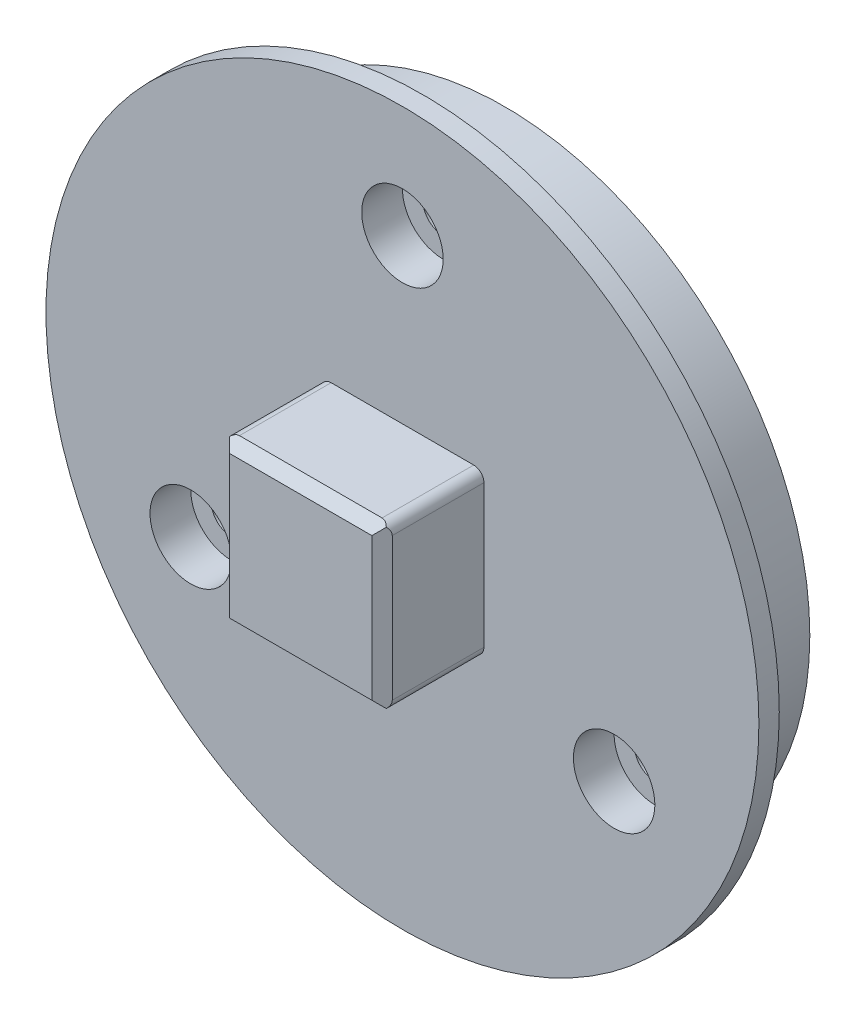
ISO-10303-21;
HEADER;
FILE_DESCRIPTION(('STEP AP214'),'2;1');
FILE_NAME('part.step','',(''),(''),'','','');
FILE_SCHEMA(('AUTOMOTIVE_DESIGN { 1 0 10303 214 1 1 1 1 }'));
ENDSEC;
DATA;
#1=APPLICATION_CONTEXT('core data for automotive mechanical design processes');
#2=APPLICATION_PROTOCOL_DEFINITION('international standard','automotive_design',2000,#1);
#3=PRODUCT_CONTEXT('',#1,'mechanical');
#4=PRODUCT('Part','Part','',(#3));
#5=PRODUCT_RELATED_PRODUCT_CATEGORY('part','',(#4));
#6=PRODUCT_DEFINITION_FORMATION('','',#4);
#7=PRODUCT_DEFINITION_CONTEXT('part definition',#1,'design');
#8=PRODUCT_DEFINITION('design','',#6,#7);
#9=PRODUCT_DEFINITION_SHAPE('','',#8);
#10=(LENGTH_UNIT() NAMED_UNIT(*) SI_UNIT(.MILLI.,.METRE.));
#11=(NAMED_UNIT(*) PLANE_ANGLE_UNIT() SI_UNIT($,.RADIAN.));
#12=(NAMED_UNIT(*) SI_UNIT($,.STERADIAN.) SOLID_ANGLE_UNIT());
#13=UNCERTAINTY_MEASURE_WITH_UNIT(LENGTH_MEASURE(1.E-05),#10,'distance_accuracy_value','');
#14=(GEOMETRIC_REPRESENTATION_CONTEXT(3) GLOBAL_UNCERTAINTY_ASSIGNED_CONTEXT((#13)) GLOBAL_UNIT_ASSIGNED_CONTEXT((#10,
#11,#12)) REPRESENTATION_CONTEXT('',''));
#15=CARTESIAN_POINT('',(0.,0.,0.));
#16=DIRECTION('',(0.,0.,1.));
#17=DIRECTION('',(1.,0.,0.));
#18=AXIS2_PLACEMENT_3D('',#15,#16,#17);
#19=CARTESIAN_POINT('',(0.,0.,5.));
#20=DIRECTION('',(0.,0.,1.));
#21=DIRECTION('',(1.,0.,0.));
#22=AXIS2_PLACEMENT_3D('',#19,#20,#21);
#23=PLANE('',#22);
#24=CARTESIAN_POINT('',(0.,12.,5.));
#25=DIRECTION('',(0.,0.,1.));
#26=DIRECTION('',(1.,0.,0.));
#27=AXIS2_PLACEMENT_3D('',#24,#25,#26);
#28=CIRCLE('',#27,2.);
#29=CARTESIAN_POINT('',(2.,12.,5.));
#30=VERTEX_POINT('',#29);
#31=EDGE_CURVE('E305',#30,#30,#28,.T.);
#32=ORIENTED_EDGE('',*,*,#31,.F.);
#33=EDGE_LOOP('',(#32));
#34=FACE_BOUND('',#33,.T.);
#35=CARTESIAN_POINT('',(10.392304845414,-5.99999999999956,5.));
#36=DIRECTION('',(0.,0.,1.));
#37=DIRECTION('',(1.,0.,0.));
#38=AXIS2_PLACEMENT_3D('',#35,#36,#37);
#39=CIRCLE('',#38,2.00000000000066);
#40=CARTESIAN_POINT('',(12.3923048454147,-5.99999999999956,5.));
#41=VERTEX_POINT('',#40);
#42=EDGE_CURVE('E299',#41,#41,#39,.T.);
#43=ORIENTED_EDGE('',*,*,#42,.F.);
#44=EDGE_LOOP('',(#43));
#45=FACE_BOUND('',#44,.T.);
#46=CARTESIAN_POINT('',(-10.3923048454125,-6.00000000000045,5.));
#47=DIRECTION('',(0.,0.,1.));
#48=DIRECTION('',(1.,0.,0.));
#49=AXIS2_PLACEMENT_3D('',#46,#47,#48);
#50=CIRCLE('',#49,2.00000000000097);
#51=CARTESIAN_POINT('',(-8.39230484541153,-6.00000000000045,5.));
#52=VERTEX_POINT('',#51);
#53=EDGE_CURVE('E292',#52,#52,#50,.T.);
#54=ORIENTED_EDGE('',*,*,#53,.F.);
#55=EDGE_LOOP('',(#54));
#56=FACE_BOUND('',#55,.T.);
#57=CARTESIAN_POINT('',(0.,0.,5.));
#58=DIRECTION('',(0.,0.,1.));
#59=DIRECTION('',(1.,0.,0.));
#60=AXIS2_PLACEMENT_3D('',#57,#58,#59);
#61=CIRCLE('',#60,17.5);
#62=CARTESIAN_POINT('',(17.5,0.,5.));
#63=VERTEX_POINT('',#62);
#64=EDGE_CURVE('E266',#63,#63,#61,.T.);
#65=ORIENTED_EDGE('',*,*,#64,.T.);
#66=EDGE_LOOP('',(#65));
#67=FACE_BOUND('',#66,.T.);
#68=DIRECTION('',(1.,0.,0.));
#69=VECTOR('',#68,1.);
#70=CARTESIAN_POINT('',(4.,-4.,5.));
#71=LINE('',#70,#69);
#72=CARTESIAN_POINT('',(-3.5,-4.,5.));
#73=VERTEX_POINT('',#72);
#74=CARTESIAN_POINT('',(3.5,-4.,5.));
#75=VERTEX_POINT('',#74);
#76=EDGE_CURVE('E228',#73,#75,#71,.T.);
#77=ORIENTED_EDGE('',*,*,#76,.F.);
#78=CARTESIAN_POINT('',(-3.5,-3.5,5.));
#79=DIRECTION('',(0.,0.,1.));
#80=DIRECTION('',(1.,0.,0.));
#81=AXIS2_PLACEMENT_3D('',#78,#79,#80);
#82=CIRCLE('',#81,0.5);
#83=CARTESIAN_POINT('',(-4.,-3.5,5.));
#84=VERTEX_POINT('',#83);
#85=EDGE_CURVE('E11',#73,#84,#82,.F.);
#86=ORIENTED_EDGE('',*,*,#85,.T.);
#87=DIRECTION('',(0.,-1.,0.));
#88=VECTOR('',#87,1.);
#89=CARTESIAN_POINT('',(-4.,-4.,5.));
#90=LINE('',#89,#88);
#91=CARTESIAN_POINT('',(-4.,3.5,5.));
#92=VERTEX_POINT('',#91);
#93=EDGE_CURVE('E179',#92,#84,#90,.T.);
#94=ORIENTED_EDGE('',*,*,#93,.F.);
#95=CARTESIAN_POINT('',(-3.5,3.5,5.));
#96=DIRECTION('',(0.,0.,1.));
#97=DIRECTION('',(1.,0.,0.));
#98=AXIS2_PLACEMENT_3D('',#95,#96,#97);
#99=CIRCLE('',#98,0.5);
#100=CARTESIAN_POINT('',(-3.5,4.,5.));
#101=VERTEX_POINT('',#100);
#102=EDGE_CURVE('E213',#92,#101,#99,.F.);
#103=ORIENTED_EDGE('',*,*,#102,.T.);
#104=DIRECTION('',(-1.,0.,0.));
#105=VECTOR('',#104,1.);
#106=CARTESIAN_POINT('',(4.,4.,5.));
#107=LINE('',#106,#105);
#108=CARTESIAN_POINT('',(3.5,4.,5.));
#109=VERTEX_POINT('',#108);
#110=EDGE_CURVE('E220',#109,#101,#107,.T.);
#111=ORIENTED_EDGE('',*,*,#110,.F.);
#112=CARTESIAN_POINT('',(3.5,3.5,5.));
#113=DIRECTION('',(0.,0.,1.));
#114=DIRECTION('',(1.,0.,0.));
#115=AXIS2_PLACEMENT_3D('',#112,#113,#114);
#116=CIRCLE('',#115,0.5);
#117=CARTESIAN_POINT('',(4.,3.5,5.));
#118=VERTEX_POINT('',#117);
#119=EDGE_CURVE('E215',#109,#118,#116,.F.);
#120=ORIENTED_EDGE('',*,*,#119,.T.);
#121=DIRECTION('',(0.,1.,0.));
#122=VECTOR('',#121,1.);
#123=CARTESIAN_POINT('',(4.,-4.,5.));
#124=LINE('',#123,#122);
#125=CARTESIAN_POINT('',(4.,-3.5,5.));
#126=VERTEX_POINT('',#125);
#127=EDGE_CURVE('E218',#126,#118,#124,.T.);
#128=ORIENTED_EDGE('',*,*,#127,.F.);
#129=CARTESIAN_POINT('',(3.5,-3.5,5.));
#130=DIRECTION('',(0.,0.,1.));
#131=DIRECTION('',(1.,0.,0.));
#132=AXIS2_PLACEMENT_3D('',#129,#130,#131);
#133=CIRCLE('',#132,0.5);
#134=EDGE_CURVE('E49',#126,#75,#133,.F.);
#135=ORIENTED_EDGE('',*,*,#134,.T.);
#136=EDGE_LOOP('',(#77,#86,#94,#103,#111,#120,#128,#135));
#137=FACE_BOUND('',#136,.T.);
#138=ADVANCED_FACE('F41',(#34,#45,#56,#67,#137),#23,.T.);
#139=CARTESIAN_POINT('',(-10.3923048454143,-5.99999999999941,2.6));
#140=DIRECTION('',(0.,0.,-1.));
#141=DIRECTION('',(-1.,0.,0.));
#142=AXIS2_PLACEMENT_3D('',#139,#140,#141);
#143=CYLINDRICAL_SURFACE('',#142,1.00000000000086);
#144=CARTESIAN_POINT('',(-10.3923048454143,-5.99999999999941,0.));
#145=DIRECTION('',(0.,0.,-1.));
#146=DIRECTION('',(-1.,0.,0.));
#147=AXIS2_PLACEMENT_3D('',#144,#145,#146);
#148=CIRCLE('',#147,1.00000000000086);
#149=CARTESIAN_POINT('',(-11.3923048454151,-5.99999999999941,0.));
#150=VERTEX_POINT('',#149);
#151=EDGE_CURVE('E280',#150,#150,#148,.T.);
#152=ORIENTED_EDGE('',*,*,#151,.T.);
#153=EDGE_LOOP('',(#152));
#154=FACE_BOUND('',#153,.T.);
#155=CARTESIAN_POINT('',(-10.3923048454143,-5.99999999999941,3.));
#156=DIRECTION('',(0.,0.,1.));
#157=DIRECTION('',(1.,0.,0.));
#158=AXIS2_PLACEMENT_3D('',#155,#156,#157);
#159=CIRCLE('',#158,1.00000000000086);
#160=CARTESIAN_POINT('',(-9.39230484541343,-5.99999999999941,3.));
#161=VERTEX_POINT('',#160);
#162=EDGE_CURVE('E253',#161,#161,#159,.F.);
#163=ORIENTED_EDGE('',*,*,#162,.F.);
#164=EDGE_LOOP('',(#163));
#165=FACE_BOUND('',#164,.T.);
#166=ADVANCED_FACE('F376',(#154,#165),#143,.F.);
#167=CARTESIAN_POINT('',(10.3923048454122,-6.00000000000059,2.6));
#168=DIRECTION('',(0.,0.,-1.));
#169=DIRECTION('',(-1.,0.,0.));
#170=AXIS2_PLACEMENT_3D('',#167,#168,#169);
#171=CYLINDRICAL_SURFACE('',#170,1.00000000000126);
#172=CARTESIAN_POINT('',(10.3923048454122,-6.00000000000059,0.));
#173=DIRECTION('',(0.,0.,-1.));
#174=DIRECTION('',(-1.,0.,0.));
#175=AXIS2_PLACEMENT_3D('',#172,#173,#174);
#176=CIRCLE('',#175,1.00000000000126);
#177=CARTESIAN_POINT('',(9.39230484541098,-6.00000000000059,0.));
#178=VERTEX_POINT('',#177);
#179=EDGE_CURVE('E273',#178,#178,#176,.T.);
#180=ORIENTED_EDGE('',*,*,#179,.T.);
#181=EDGE_LOOP('',(#180));
#182=FACE_BOUND('',#181,.T.);
#183=CARTESIAN_POINT('',(10.3923048454122,-6.00000000000059,3.));
#184=DIRECTION('',(0.,0.,1.));
#185=DIRECTION('',(1.,0.,0.));
#186=AXIS2_PLACEMENT_3D('',#183,#184,#185);
#187=CIRCLE('',#186,1.00000000000126);
#188=CARTESIAN_POINT('',(11.3923048454135,-6.00000000000059,3.));
#189=VERTEX_POINT('',#188);
#190=EDGE_CURVE('E257',#189,#189,#187,.F.);
#191=ORIENTED_EDGE('',*,*,#190,.F.);
#192=EDGE_LOOP('',(#191));
#193=FACE_BOUND('',#192,.T.);
#194=ADVANCED_FACE('F384',(#182,#193),#171,.F.);
#195=CARTESIAN_POINT('',(0.,12.,2.6));
#196=DIRECTION('',(0.,0.,-1.));
#197=DIRECTION('',(-1.,0.,0.));
#198=AXIS2_PLACEMENT_3D('',#195,#196,#197);
#199=CYLINDRICAL_SURFACE('',#198,1.);
#200=CARTESIAN_POINT('',(0.,12.,0.));
#201=DIRECTION('',(0.,0.,-1.));
#202=DIRECTION('',(-1.,0.,0.));
#203=AXIS2_PLACEMENT_3D('',#200,#201,#202);
#204=CIRCLE('',#203,1.);
#205=CARTESIAN_POINT('',(-1.,12.,0.));
#206=VERTEX_POINT('',#205);
#207=EDGE_CURVE('E272',#206,#206,#204,.T.);
#208=ORIENTED_EDGE('',*,*,#207,.T.);
#209=EDGE_LOOP('',(#208));
#210=FACE_BOUND('',#209,.T.);
#211=CARTESIAN_POINT('',(0.,12.,3.));
#212=DIRECTION('',(0.,0.,1.));
#213=DIRECTION('',(1.,0.,0.));
#214=AXIS2_PLACEMENT_3D('',#211,#212,#213);
#215=CIRCLE('',#214,1.);
#216=CARTESIAN_POINT('',(1.,12.,3.));
#217=VERTEX_POINT('',#216);
#218=EDGE_CURVE('E260',#217,#217,#215,.F.);
#219=ORIENTED_EDGE('',*,*,#218,.F.);
#220=EDGE_LOOP('',(#219));
#221=FACE_BOUND('',#220,.T.);
#222=ADVANCED_FACE('F345',(#210,#221),#199,.F.);
#223=CARTESIAN_POINT('',(0.,0.,0.));
#224=DIRECTION('',(0.,0.,1.));
#225=DIRECTION('',(1.,0.,0.));
#226=AXIS2_PLACEMENT_3D('',#223,#224,#225);
#227=PLANE('',#226);
#228=CARTESIAN_POINT('',(0.,0.,0.));
#229=DIRECTION('',(0.,0.,-1.));
#230=DIRECTION('',(-1.,0.,0.));
#231=AXIS2_PLACEMENT_3D('',#228,#229,#230);
#232=CIRCLE('',#231,2.5);
#233=CARTESIAN_POINT('',(-2.5,0.,0.));
#234=VERTEX_POINT('',#233);
#235=EDGE_CURVE('E327',#234,#234,#232,.T.);
#236=ORIENTED_EDGE('',*,*,#235,.F.);
#237=EDGE_LOOP('',(#236));
#238=FACE_BOUND('',#237,.T.);
#239=ORIENTED_EDGE('',*,*,#207,.F.);
#240=EDGE_LOOP('',(#239));
#241=FACE_BOUND('',#240,.T.);
#242=CARTESIAN_POINT('',(10.3923048454129,5.9999999999994,0.));
#243=DIRECTION('',(0.,0.,-1.));
#244=DIRECTION('',(-1.,0.,0.));
#245=AXIS2_PLACEMENT_3D('',#242,#243,#244);
#246=CIRCLE('',#245,1.00000000000064);
#247=CARTESIAN_POINT('',(9.39230484541229,5.9999999999994,0.));
#248=VERTEX_POINT('',#247);
#249=EDGE_CURVE('E277',#248,#248,#246,.T.);
#250=ORIENTED_EDGE('',*,*,#249,.F.);
#251=EDGE_LOOP('',(#250));
#252=FACE_BOUND('',#251,.T.);
#253=ORIENTED_EDGE('',*,*,#179,.F.);
#254=EDGE_LOOP('',(#253));
#255=FACE_BOUND('',#254,.T.);
#256=CARTESIAN_POINT('',(-1.36130290034144E-12,-12.,0.));
#257=DIRECTION('',(0.,0.,-1.));
#258=DIRECTION('',(-1.,0.,0.));
#259=AXIS2_PLACEMENT_3D('',#256,#257,#258);
#260=CIRCLE('',#259,1.00000000000138);
#261=CARTESIAN_POINT('',(-1.00000000000274,-12.,0.));
#262=VERTEX_POINT('',#261);
#263=EDGE_CURVE('E276',#262,#262,#260,.T.);
#264=ORIENTED_EDGE('',*,*,#263,.F.);
#265=EDGE_LOOP('',(#264));
#266=FACE_BOUND('',#265,.T.);
#267=ORIENTED_EDGE('',*,*,#151,.F.);
#268=EDGE_LOOP('',(#267));
#269=FACE_BOUND('',#268,.T.);
#270=CARTESIAN_POINT('',(-10.3923048454136,6.00000000000059,0.));
#271=DIRECTION('',(0.,0.,-1.));
#272=DIRECTION('',(-1.,0.,0.));
#273=AXIS2_PLACEMENT_3D('',#270,#271,#272);
#274=CIRCLE('',#273,1.00000000000018);
#275=CARTESIAN_POINT('',(-11.3923048454138,6.00000000000059,0.));
#276=VERTEX_POINT('',#275);
#277=EDGE_CURVE('E283',#276,#276,#274,.T.);
#278=ORIENTED_EDGE('',*,*,#277,.F.);
#279=EDGE_LOOP('',(#278));
#280=FACE_BOUND('',#279,.T.);
#281=CARTESIAN_POINT('',(0.,0.,0.));
#282=DIRECTION('',(0.,0.,1.));
#283=DIRECTION('',(1.,0.,0.));
#284=AXIS2_PLACEMENT_3D('',#281,#282,#283);
#285=CIRCLE('',#284,15.);
#286=CARTESIAN_POINT('',(15.,0.,0.));
#287=VERTEX_POINT('',#286);
#288=EDGE_CURVE('E269',#287,#287,#285,.T.);
#289=ORIENTED_EDGE('',*,*,#288,.F.);
#290=EDGE_LOOP('',(#289));
#291=FACE_BOUND('',#290,.T.);
#292=ADVANCED_FACE('F341',(#238,#241,#252,#255,#266,#269,#280,#291),#227,.F.);
#293=CARTESIAN_POINT('',(0.,0.,-42.4264068711929));
#294=DIRECTION('',(0.,0.,1.));
#295=DIRECTION('',(1.,0.,0.));
#296=AXIS2_PLACEMENT_3D('',#293,#294,#295);
#297=CYLINDRICAL_SURFACE('',#296,15.);
#298=CARTESIAN_POINT('',(0.,0.,3.6));
#299=DIRECTION('',(0.,0.,-1.));
#300=DIRECTION('',(-1.,0.,0.));
#301=AXIS2_PLACEMENT_3D('',#298,#299,#300);
#302=CIRCLE('',#301,15.);
#303=CARTESIAN_POINT('',(-15.,0.,3.6));
#304=VERTEX_POINT('',#303);
#305=EDGE_CURVE('E256',#304,#304,#302,.T.);
#306=ORIENTED_EDGE('',*,*,#305,.T.);
#307=EDGE_LOOP('',(#306));
#308=FACE_BOUND('',#307,.T.);
#309=ORIENTED_EDGE('',*,*,#288,.T.);
#310=EDGE_LOOP('',(#309));
#311=FACE_BOUND('',#310,.T.);
#312=ADVANCED_FACE('F344',(#308,#311),#297,.T.);
#313=CARTESIAN_POINT('',(-10.3923048454136,6.00000000000059,2.6));
#314=DIRECTION('',(0.,0.,-1.));
#315=DIRECTION('',(-1.,0.,0.));
#316=AXIS2_PLACEMENT_3D('',#313,#314,#315);
#317=CYLINDRICAL_SURFACE('',#316,1.00000000000018);
#318=CARTESIAN_POINT('',(-10.3923048454136,6.00000000000059,2.1));
#319=DIRECTION('',(0.,0.,-1.));
#320=DIRECTION('',(-1.,0.,0.));
#321=AXIS2_PLACEMENT_3D('',#318,#319,#320);
#322=CIRCLE('',#321,1.00000000000013);
#323=CARTESIAN_POINT('',(-11.3923048454137,6.00000000000059,2.1));
#324=VERTEX_POINT('',#323);
#325=EDGE_CURVE('E313',#324,#324,#322,.T.);
#326=ORIENTED_EDGE('',*,*,#325,.F.);
#327=EDGE_LOOP('',(#326));
#328=FACE_BOUND('',#327,.T.);
#329=ORIENTED_EDGE('',*,*,#277,.T.);
#330=EDGE_LOOP('',(#329));
#331=FACE_BOUND('',#330,.T.);
#332=ADVANCED_FACE('F362',(#328,#331),#317,.F.);
#333=CARTESIAN_POINT('',(-1.36130290034144E-12,-12.,2.6));
#334=DIRECTION('',(0.,0.,-1.));
#335=DIRECTION('',(-1.,0.,0.));
#336=AXIS2_PLACEMENT_3D('',#333,#334,#335);
#337=CYLINDRICAL_SURFACE('',#336,1.00000000000138);
#338=CARTESIAN_POINT('',(-1.1035275567338E-12,-12.000000000001,2.1));
#339=DIRECTION('',(0.,0.,-1.));
#340=DIRECTION('',(-1.,0.,0.));
#341=AXIS2_PLACEMENT_3D('',#338,#339,#340);
#342=CIRCLE('',#341,0.999999999999898);
#343=CARTESIAN_POINT('',(-1.000000000001,-12.000000000001,2.1));
#344=VERTEX_POINT('',#343);
#345=EDGE_CURVE('E318',#344,#344,#342,.T.);
#346=ORIENTED_EDGE('',*,*,#345,.F.);
#347=EDGE_LOOP('',(#346));
#348=FACE_BOUND('',#347,.T.);
#349=ORIENTED_EDGE('',*,*,#263,.T.);
#350=EDGE_LOOP('',(#349));
#351=FACE_BOUND('',#350,.T.);
#352=ADVANCED_FACE('F370',(#348,#351),#337,.F.);
#353=CARTESIAN_POINT('',(10.3923048454129,5.9999999999994,2.6));
#354=DIRECTION('',(0.,0.,-1.));
#355=DIRECTION('',(-1.,0.,0.));
#356=AXIS2_PLACEMENT_3D('',#353,#354,#355);
#357=CYLINDRICAL_SURFACE('',#356,1.00000000000064);
#358=CARTESIAN_POINT('',(10.3923048454139,5.99999999999913,2.1));
#359=DIRECTION('',(0.,0.,-1.));
#360=DIRECTION('',(-1.,0.,0.));
#361=AXIS2_PLACEMENT_3D('',#358,#359,#360);
#362=CIRCLE('',#361,1.00000000000075);
#363=CARTESIAN_POINT('',(9.3923048454132,5.99999999999913,2.1));
#364=VERTEX_POINT('',#363);
#365=EDGE_CURVE('E321',#364,#364,#362,.T.);
#366=ORIENTED_EDGE('',*,*,#365,.F.);
#367=EDGE_LOOP('',(#366));
#368=FACE_BOUND('',#367,.T.);
#369=ORIENTED_EDGE('',*,*,#249,.T.);
#370=EDGE_LOOP('',(#369));
#371=FACE_BOUND('',#370,.T.);
#372=ADVANCED_FACE('F482',(#368,#371),#357,.F.);
#373=CARTESIAN_POINT('',(0.,0.,3.6));
#374=DIRECTION('',(0.,0.,-1.));
#375=DIRECTION('',(-1.,0.,0.));
#376=AXIS2_PLACEMENT_3D('',#373,#374,#375);
#377=PLANE('',#376);
#378=ORIENTED_EDGE('',*,*,#305,.F.);
#379=EDGE_LOOP('',(#378));
#380=FACE_BOUND('',#379,.T.);
#381=CARTESIAN_POINT('',(0.,0.,3.6));
#382=DIRECTION('',(0.,0.,-1.));
#383=DIRECTION('',(-1.,0.,0.));
#384=AXIS2_PLACEMENT_3D('',#381,#382,#383);
#385=CIRCLE('',#384,16.5);
#386=CARTESIAN_POINT('',(-16.5,0.,3.6));
#387=VERTEX_POINT('',#386);
#388=EDGE_CURVE('E296',#387,#387,#385,.T.);
#389=ORIENTED_EDGE('',*,*,#388,.T.);
#390=EDGE_LOOP('',(#389));
#391=FACE_BOUND('',#390,.T.);
#392=ADVANCED_FACE('F479',(#380,#391),#377,.T.);
#393=CARTESIAN_POINT('',(0.,0.,-45.4974746830583));
#394=DIRECTION('',(0.,0.,1.));
#395=DIRECTION('',(1.,0.,0.));
#396=AXIS2_PLACEMENT_3D('',#393,#394,#395);
#397=CYLINDRICAL_SURFACE('',#396,17.5);
#398=CARTESIAN_POINT('',(0.,0.,4.));
#399=DIRECTION('',(0.,0.,1.));
#400=DIRECTION('',(1.,0.,0.));
#401=AXIS2_PLACEMENT_3D('',#398,#399,#400);
#402=CIRCLE('',#401,17.5);
#403=CARTESIAN_POINT('',(17.5,0.,4.));
#404=VERTEX_POINT('',#403);
#405=EDGE_CURVE('E151',#404,#404,#402,.F.);
#406=ORIENTED_EDGE('',*,*,#405,.F.);
#407=EDGE_LOOP('',(#406));
#408=FACE_BOUND('',#407,.T.);
#409=ORIENTED_EDGE('',*,*,#64,.F.);
#410=EDGE_LOOP('',(#409));
#411=FACE_BOUND('',#410,.T.);
#412=ADVANCED_FACE('F390',(#408,#411),#397,.T.);
#413=CARTESIAN_POINT('',(0.,0.,4.));
#414=DIRECTION('',(0.,0.,1.));
#415=DIRECTION('',(1.,0.,0.));
#416=AXIS2_PLACEMENT_3D('',#413,#414,#415);
#417=PLANE('',#416);
#418=CARTESIAN_POINT('',(0.,0.,4.));
#419=DIRECTION('',(0.,0.,1.));
#420=DIRECTION('',(1.,0.,0.));
#421=AXIS2_PLACEMENT_3D('',#418,#419,#420);
#422=CIRCLE('',#421,16.5);
#423=CARTESIAN_POINT('',(16.5,0.,4.));
#424=VERTEX_POINT('',#423);
#425=EDGE_CURVE('E310',#424,#424,#422,.F.);
#426=ORIENTED_EDGE('',*,*,#425,.F.);
#427=EDGE_LOOP('',(#426));
#428=FACE_BOUND('',#427,.T.);
#429=ORIENTED_EDGE('',*,*,#405,.T.);
#430=EDGE_LOOP('',(#429));
#431=FACE_BOUND('',#430,.T.);
#432=ADVANCED_FACE('F391',(#428,#431),#417,.F.);
#433=CARTESIAN_POINT('',(-10.3923048454125,-6.00000000000045,3.));
#434=DIRECTION('',(0.,0.,1.));
#435=DIRECTION('',(1.,0.,0.));
#436=AXIS2_PLACEMENT_3D('',#433,#434,#435);
#437=PLANE('',#436);
#438=CARTESIAN_POINT('',(-10.3923048454125,-6.00000000000045,3.));
#439=DIRECTION('',(0.,0.,1.));
#440=DIRECTION('',(1.,0.,0.));
#441=AXIS2_PLACEMENT_3D('',#438,#439,#440);
#442=CIRCLE('',#441,2.00000000000097);
#443=CARTESIAN_POINT('',(-8.39230484541153,-6.00000000000045,3.));
#444=VERTEX_POINT('',#443);
#445=EDGE_CURVE('E295',#444,#444,#442,.T.);
#446=ORIENTED_EDGE('',*,*,#445,.T.);
#447=EDGE_LOOP('',(#446));
#448=FACE_BOUND('',#447,.T.);
#449=ORIENTED_EDGE('',*,*,#162,.T.);
#450=EDGE_LOOP('',(#449));
#451=FACE_BOUND('',#450,.T.);
#452=ADVANCED_FACE('F393',(#448,#451),#437,.T.);
#453=CARTESIAN_POINT('',(-10.3923048454125,-6.00000000000045,3.));
#454=DIRECTION('',(0.,0.,1.));
#455=DIRECTION('',(1.,0.,0.));
#456=AXIS2_PLACEMENT_3D('',#453,#454,#455);
#457=CYLINDRICAL_SURFACE('',#456,2.00000000000097);
#458=ORIENTED_EDGE('',*,*,#445,.F.);
#459=EDGE_LOOP('',(#458));
#460=FACE_BOUND('',#459,.T.);
#461=ORIENTED_EDGE('',*,*,#53,.T.);
#462=EDGE_LOOP('',(#461));
#463=FACE_BOUND('',#462,.T.);
#464=ADVANCED_FACE('F468',(#460,#463),#457,.F.);
#465=CARTESIAN_POINT('',(10.392304845414,-5.99999999999956,3.));
#466=DIRECTION('',(0.,0.,1.));
#467=DIRECTION('',(1.,0.,0.));
#468=AXIS2_PLACEMENT_3D('',#465,#466,#467);
#469=PLANE('',#468);
#470=CARTESIAN_POINT('',(10.392304845414,-5.99999999999956,3.));
#471=DIRECTION('',(0.,0.,1.));
#472=DIRECTION('',(1.,0.,0.));
#473=AXIS2_PLACEMENT_3D('',#470,#471,#472);
#474=CIRCLE('',#473,2.00000000000066);
#475=CARTESIAN_POINT('',(12.3923048454147,-5.99999999999956,3.));
#476=VERTEX_POINT('',#475);
#477=EDGE_CURVE('E302',#476,#476,#474,.T.);
#478=ORIENTED_EDGE('',*,*,#477,.T.);
#479=EDGE_LOOP('',(#478));
#480=FACE_BOUND('',#479,.T.);
#481=ORIENTED_EDGE('',*,*,#190,.T.);
#482=EDGE_LOOP('',(#481));
#483=FACE_BOUND('',#482,.T.);
#484=ADVANCED_FACE('F465',(#480,#483),#469,.T.);
#485=CARTESIAN_POINT('',(10.392304845414,-5.99999999999956,3.));
#486=DIRECTION('',(0.,0.,1.));
#487=DIRECTION('',(1.,0.,0.));
#488=AXIS2_PLACEMENT_3D('',#485,#486,#487);
#489=CYLINDRICAL_SURFACE('',#488,2.00000000000066);
#490=ORIENTED_EDGE('',*,*,#477,.F.);
#491=EDGE_LOOP('',(#490));
#492=FACE_BOUND('',#491,.T.);
#493=ORIENTED_EDGE('',*,*,#42,.T.);
#494=EDGE_LOOP('',(#493));
#495=FACE_BOUND('',#494,.T.);
#496=ADVANCED_FACE('F460',(#492,#495),#489,.F.);
#497=CARTESIAN_POINT('',(0.,12.,3.));
#498=DIRECTION('',(0.,0.,1.));
#499=DIRECTION('',(1.,0.,0.));
#500=AXIS2_PLACEMENT_3D('',#497,#498,#499);
#501=PLANE('',#500);
#502=CARTESIAN_POINT('',(0.,12.,3.));
#503=DIRECTION('',(0.,0.,1.));
#504=DIRECTION('',(1.,0.,0.));
#505=AXIS2_PLACEMENT_3D('',#502,#503,#504);
#506=CIRCLE('',#505,2.);
#507=CARTESIAN_POINT('',(2.,12.,3.));
#508=VERTEX_POINT('',#507);
#509=EDGE_CURVE('E263',#508,#508,#506,.T.);
#510=ORIENTED_EDGE('',*,*,#509,.T.);
#511=EDGE_LOOP('',(#510));
#512=FACE_BOUND('',#511,.T.);
#513=ORIENTED_EDGE('',*,*,#218,.T.);
#514=EDGE_LOOP('',(#513));
#515=FACE_BOUND('',#514,.T.);
#516=ADVANCED_FACE('F457',(#512,#515),#501,.T.);
#517=CARTESIAN_POINT('',(0.,12.,3.));
#518=DIRECTION('',(0.,0.,1.));
#519=DIRECTION('',(1.,0.,0.));
#520=AXIS2_PLACEMENT_3D('',#517,#518,#519);
#521=CYLINDRICAL_SURFACE('',#520,2.);
#522=ORIENTED_EDGE('',*,*,#509,.F.);
#523=EDGE_LOOP('',(#522));
#524=FACE_BOUND('',#523,.T.);
#525=ORIENTED_EDGE('',*,*,#31,.T.);
#526=EDGE_LOOP('',(#525));
#527=FACE_BOUND('',#526,.T.);
#528=ADVANCED_FACE('F455',(#524,#527),#521,.F.);
#529=CARTESIAN_POINT('',(0.,0.,50.6690475583121));
#530=DIRECTION('',(0.,0.,-1.));
#531=DIRECTION('',(-1.,0.,0.));
#532=AXIS2_PLACEMENT_3D('',#529,#530,#531);
#533=CYLINDRICAL_SURFACE('',#532,16.5);
#534=ORIENTED_EDGE('',*,*,#388,.F.);
#535=EDGE_LOOP('',(#534));
#536=FACE_BOUND('',#535,.T.);
#537=ORIENTED_EDGE('',*,*,#425,.T.);
#538=EDGE_LOOP('',(#537));
#539=FACE_BOUND('',#538,.T.);
#540=ADVANCED_FACE('F451',(#536,#539),#533,.T.);
#541=CARTESIAN_POINT('',(-10.3923048454136,6.00000000000059,2.1));
#542=DIRECTION('',(0.,0.,-1.));
#543=DIRECTION('',(-1.,0.,0.));
#544=AXIS2_PLACEMENT_3D('',#541,#542,#543);
#545=PLANE('',#544);
#546=ORIENTED_EDGE('',*,*,#325,.T.);
#547=EDGE_LOOP('',(#546));
#548=FACE_BOUND('',#547,.T.);
#549=ADVANCED_FACE('F447',(#548),#545,.T.);
#550=CARTESIAN_POINT('',(-1.1035275567338E-12,-12.000000000001,2.1));
#551=DIRECTION('',(0.,0.,-1.));
#552=DIRECTION('',(-1.,0.,0.));
#553=AXIS2_PLACEMENT_3D('',#550,#551,#552);
#554=PLANE('',#553);
#555=ORIENTED_EDGE('',*,*,#345,.T.);
#556=EDGE_LOOP('',(#555));
#557=FACE_BOUND('',#556,.T.);
#558=ADVANCED_FACE('F443',(#557),#554,.T.);
#559=CARTESIAN_POINT('',(10.3923048454139,5.99999999999913,2.1));
#560=DIRECTION('',(0.,0.,-1.));
#561=DIRECTION('',(-1.,0.,0.));
#562=AXIS2_PLACEMENT_3D('',#559,#560,#561);
#563=PLANE('',#562);
#564=ORIENTED_EDGE('',*,*,#365,.T.);
#565=EDGE_LOOP('',(#564));
#566=FACE_BOUND('',#565,.T.);
#567=ADVANCED_FACE('F437',(#566),#563,.T.);
#568=CARTESIAN_POINT('',(-4.,-4.,10.));
#569=DIRECTION('',(1.,0.,0.));
#570=DIRECTION('',(0.,0.,-1.));
#571=AXIS2_PLACEMENT_3D('',#568,#569,#570);
#572=PLANE('',#571);
#573=DIRECTION('',(0.,1.,0.));
#574=VECTOR('',#573,1.);
#575=CARTESIAN_POINT('',(-4.,4.,9.5));
#576=LINE('',#575,#574);
#577=CARTESIAN_POINT('',(-4.,-3.5,9.5));
#578=VERTEX_POINT('',#577);
#579=CARTESIAN_POINT('',(-4.,3.5,9.5));
#580=VERTEX_POINT('',#579);
#581=EDGE_CURVE('E170',#578,#580,#576,.T.);
#582=ORIENTED_EDGE('',*,*,#581,.T.);
#583=DIRECTION('',(0.,0.,-1.));
#584=VECTOR('',#583,1.);
#585=CARTESIAN_POINT('',(-4.,3.5,10.));
#586=LINE('',#585,#584);
#587=EDGE_CURVE('E181',#580,#92,#586,.T.);
#588=ORIENTED_EDGE('',*,*,#587,.T.);
#589=ORIENTED_EDGE('',*,*,#93,.T.);
#590=DIRECTION('',(0.,0.,-1.));
#591=VECTOR('',#590,1.);
#592=CARTESIAN_POINT('',(-4.,-3.5,10.));
#593=LINE('',#592,#591);
#594=EDGE_CURVE('E172',#84,#578,#593,.F.);
#595=ORIENTED_EDGE('',*,*,#594,.T.);
#596=EDGE_LOOP('',(#582,#588,#589,#595));
#597=FACE_BOUND('',#596,.T.);
#598=ADVANCED_FACE('F244',(#597),#572,.F.);
#599=CARTESIAN_POINT('',(4.,-4.,10.));
#600=DIRECTION('',(0.,1.,0.));
#601=DIRECTION('',(0.,0.,1.));
#602=AXIS2_PLACEMENT_3D('',#599,#600,#601);
#603=PLANE('',#602);
#604=ORIENTED_EDGE('',*,*,#76,.T.);
#605=DIRECTION('',(0.,0.,-1.));
#606=VECTOR('',#605,1.);
#607=CARTESIAN_POINT('',(3.5,-4.,10.));
#608=LINE('',#607,#606);
#609=CARTESIAN_POINT('',(3.5,-4.,9.5));
#610=VERTEX_POINT('',#609);
#611=EDGE_CURVE('E207',#75,#610,#608,.F.);
#612=ORIENTED_EDGE('',*,*,#611,.T.);
#613=DIRECTION('',(-1.,0.,0.));
#614=VECTOR('',#613,1.);
#615=CARTESIAN_POINT('',(-4.,-4.,9.5));
#616=LINE('',#615,#614);
#617=CARTESIAN_POINT('',(-3.5,-4.,9.5));
#618=VERTEX_POINT('',#617);
#619=EDGE_CURVE('E167',#610,#618,#616,.T.);
#620=ORIENTED_EDGE('',*,*,#619,.T.);
#621=DIRECTION('',(0.,0.,-1.));
#622=VECTOR('',#621,1.);
#623=CARTESIAN_POINT('',(-3.5,-4.,10.));
#624=LINE('',#623,#622);
#625=EDGE_CURVE('E205',#618,#73,#624,.T.);
#626=ORIENTED_EDGE('',*,*,#625,.T.);
#627=EDGE_LOOP('',(#604,#612,#620,#626));
#628=FACE_BOUND('',#627,.T.);
#629=ADVANCED_FACE('F429',(#628),#603,.F.);
#630=CARTESIAN_POINT('',(4.,-4.,10.));
#631=DIRECTION('',(-1.,0.,0.));
#632=DIRECTION('',(0.,0.,1.));
#633=AXIS2_PLACEMENT_3D('',#630,#631,#632);
#634=PLANE('',#633);
#635=ORIENTED_EDGE('',*,*,#127,.T.);
#636=DIRECTION('',(0.,0.,-1.));
#637=VECTOR('',#636,1.);
#638=CARTESIAN_POINT('',(4.,3.5,10.));
#639=LINE('',#638,#637);
#640=CARTESIAN_POINT('',(4.,3.5,9.5));
#641=VERTEX_POINT('',#640);
#642=EDGE_CURVE('E199',#118,#641,#639,.F.);
#643=ORIENTED_EDGE('',*,*,#642,.T.);
#644=DIRECTION('',(0.,-1.,0.));
#645=VECTOR('',#644,1.);
#646=CARTESIAN_POINT('',(4.,-4.,9.5));
#647=LINE('',#646,#645);
#648=CARTESIAN_POINT('',(4.,-3.5,9.5));
#649=VERTEX_POINT('',#648);
#650=EDGE_CURVE('E160',#641,#649,#647,.T.);
#651=ORIENTED_EDGE('',*,*,#650,.T.);
#652=DIRECTION('',(0.,0.,-1.));
#653=VECTOR('',#652,1.);
#654=CARTESIAN_POINT('',(4.,-3.5,10.));
#655=LINE('',#654,#653);
#656=EDGE_CURVE('E196',#649,#126,#655,.T.);
#657=ORIENTED_EDGE('',*,*,#656,.T.);
#658=EDGE_LOOP('',(#635,#643,#651,#657));
#659=FACE_BOUND('',#658,.T.);
#660=ADVANCED_FACE('F225',(#659),#634,.F.);
#661=CARTESIAN_POINT('',(4.,4.,10.));
#662=DIRECTION('',(0.,-1.,0.));
#663=DIRECTION('',(1.,0.,0.));
#664=AXIS2_PLACEMENT_3D('',#661,#662,#663);
#665=PLANE('',#664);
#666=ORIENTED_EDGE('',*,*,#110,.T.);
#667=DIRECTION('',(0.,0.,-1.));
#668=VECTOR('',#667,1.);
#669=CARTESIAN_POINT('',(-3.5,4.,10.));
#670=LINE('',#669,#668);
#671=CARTESIAN_POINT('',(-3.5,4.,9.5));
#672=VERTEX_POINT('',#671);
#673=EDGE_CURVE('E187',#101,#672,#670,.F.);
#674=ORIENTED_EDGE('',*,*,#673,.T.);
#675=DIRECTION('',(1.,0.,0.));
#676=VECTOR('',#675,1.);
#677=CARTESIAN_POINT('',(4.,4.,9.5));
#678=LINE('',#677,#676);
#679=CARTESIAN_POINT('',(3.5,4.,9.5));
#680=VERTEX_POINT('',#679);
#681=EDGE_CURVE('E157',#672,#680,#678,.T.);
#682=ORIENTED_EDGE('',*,*,#681,.T.);
#683=DIRECTION('',(0.,0.,-1.));
#684=VECTOR('',#683,1.);
#685=CARTESIAN_POINT('',(3.5,4.,10.));
#686=LINE('',#685,#684);
#687=EDGE_CURVE('E184',#680,#109,#686,.T.);
#688=ORIENTED_EDGE('',*,*,#687,.T.);
#689=EDGE_LOOP('',(#666,#674,#682,#688));
#690=FACE_BOUND('',#689,.T.);
#691=ADVANCED_FACE('F236',(#690),#665,.F.);
#692=CARTESIAN_POINT('',(0.,0.,10.));
#693=DIRECTION('',(0.,0.,1.));
#694=DIRECTION('',(1.,0.,0.));
#695=AXIS2_PLACEMENT_3D('',#692,#693,#694);
#696=PLANE('',#695);
#697=DIRECTION('',(0.,1.,0.));
#698=VECTOR('',#697,1.);
#699=CARTESIAN_POINT('',(3.5,4.,10.));
#700=LINE('',#699,#698);
#701=CARTESIAN_POINT('',(3.5,-3.5,10.));
#702=VERTEX_POINT('',#701);
#703=CARTESIAN_POINT('',(3.5,3.5,10.));
#704=VERTEX_POINT('',#703);
#705=EDGE_CURVE('E155',#702,#704,#700,.T.);
#706=ORIENTED_EDGE('',*,*,#705,.T.);
#707=DIRECTION('',(-1.,0.,0.));
#708=VECTOR('',#707,1.);
#709=CARTESIAN_POINT('',(-4.,3.5,10.));
#710=LINE('',#709,#708);
#711=CARTESIAN_POINT('',(-3.5,3.5,10.));
#712=VERTEX_POINT('',#711);
#713=EDGE_CURVE('E135',#704,#712,#710,.T.);
#714=ORIENTED_EDGE('',*,*,#713,.T.);
#715=DIRECTION('',(0.,-1.,0.));
#716=VECTOR('',#715,1.);
#717=CARTESIAN_POINT('',(-3.5,-4.,10.));
#718=LINE('',#717,#716);
#719=CARTESIAN_POINT('',(-3.5,-3.5,10.));
#720=VERTEX_POINT('',#719);
#721=EDGE_CURVE('E144',#712,#720,#718,.T.);
#722=ORIENTED_EDGE('',*,*,#721,.T.);
#723=DIRECTION('',(1.,0.,0.));
#724=VECTOR('',#723,1.);
#725=CARTESIAN_POINT('',(4.,-3.5,10.));
#726=LINE('',#725,#724);
#727=EDGE_CURVE('E150',#720,#702,#726,.T.);
#728=ORIENTED_EDGE('',*,*,#727,.T.);
#729=EDGE_LOOP('',(#706,#714,#722,#728));
#730=FACE_BOUND('',#729,.T.);
#731=ADVANCED_FACE('F153',(#730),#696,.T.);
#732=CARTESIAN_POINT('',(0.,-3.5,10.));
#733=DIRECTION('',(0.,-0.707106781186547,0.707106781186547));
#734=DIRECTION('',(-1.,0.,0.));
#735=AXIS2_PLACEMENT_3D('',#732,#733,#734);
#736=PLANE('',#735);
#737=ORIENTED_EDGE('',*,*,#619,.F.);
#738=CARTESIAN_POINT('',(3.5,-3.5,10.));
#739=DIRECTION('',(0.,-0.707106781186547,0.707106781186547));
#740=DIRECTION('',(0.,-0.707106781186548,-0.707106781186548));
#741=AXIS2_PLACEMENT_3D('',#738,#739,#740);
#742=ELLIPSE('',#741,0.707106781186548,0.5);
#743=CARTESIAN_POINT('',(3.85355339059327,-3.85355339059327,9.64644660940673));
#744=VERTEX_POINT('',#743);
#745=EDGE_CURVE('E211',#610,#744,#742,.T.);
#746=ORIENTED_EDGE('',*,*,#745,.T.);
#747=DIRECTION('',(-0.577350269189626,0.577350269189626,0.577350269189626));
#748=VECTOR('',#747,1.);
#749=CARTESIAN_POINT('',(2.33333333333333,-2.33333333333333,11.1666666666667));
#750=LINE('',#749,#748);
#751=EDGE_CURVE('E176',#702,#744,#750,.F.);
#752=ORIENTED_EDGE('',*,*,#751,.F.);
#753=ORIENTED_EDGE('',*,*,#727,.F.);
#754=DIRECTION('',(0.577350269189626,0.577350269189626,0.577350269189626));
#755=VECTOR('',#754,1.);
#756=CARTESIAN_POINT('',(-2.33333333333333,-2.33333333333333,11.1666666666667));
#757=LINE('',#756,#755);
#758=CARTESIAN_POINT('',(-3.85355339059327,-3.85355339059327,9.64644660940673));
#759=VERTEX_POINT('',#758);
#760=EDGE_CURVE('E147',#759,#720,#757,.T.);
#761=ORIENTED_EDGE('',*,*,#760,.F.);
#762=CARTESIAN_POINT('',(-3.5,-3.5,10.));
#763=DIRECTION('',(0.,-0.707106781186547,0.707106781186547));
#764=DIRECTION('',(0.,-0.707106781186548,-0.707106781186548));
#765=AXIS2_PLACEMENT_3D('',#762,#763,#764);
#766=ELLIPSE('',#765,0.707106781186548,0.5);
#767=EDGE_CURVE('E209',#759,#618,#766,.T.);
#768=ORIENTED_EDGE('',*,*,#767,.T.);
#769=EDGE_LOOP('',(#737,#746,#752,#753,#761,#768));
#770=FACE_BOUND('',#769,.T.);
#771=ADVANCED_FACE('F250',(#770),#736,.T.);
#772=CARTESIAN_POINT('',(3.5,0.,10.));
#773=DIRECTION('',(0.707106781186547,0.,0.707106781186547));
#774=DIRECTION('',(0.,-1.,0.));
#775=AXIS2_PLACEMENT_3D('',#772,#773,#774);
#776=PLANE('',#775);
#777=ORIENTED_EDGE('',*,*,#650,.F.);
#778=CARTESIAN_POINT('',(3.5,3.5,10.));
#779=DIRECTION('',(0.707106781186547,0.,0.707106781186547));
#780=DIRECTION('',(0.707106781186548,0.,-0.707106781186548));
#781=AXIS2_PLACEMENT_3D('',#778,#779,#780);
#782=ELLIPSE('',#781,0.707106781186548,0.5);
#783=CARTESIAN_POINT('',(3.85355339059327,3.85355339059327,9.64644660940673));
#784=VERTEX_POINT('',#783);
#785=EDGE_CURVE('E203',#641,#784,#782,.T.);
#786=ORIENTED_EDGE('',*,*,#785,.T.);
#787=DIRECTION('',(-0.577350269189626,-0.577350269189626,0.577350269189626));
#788=VECTOR('',#787,1.);
#789=CARTESIAN_POINT('',(2.33333333333333,2.33333333333333,11.1666666666667));
#790=LINE('',#789,#788);
#791=EDGE_CURVE('E140',#704,#784,#790,.F.);
#792=ORIENTED_EDGE('',*,*,#791,.F.);
#793=ORIENTED_EDGE('',*,*,#705,.F.);
#794=ORIENTED_EDGE('',*,*,#751,.T.);
#795=CARTESIAN_POINT('',(3.5,-3.5,10.));
#796=DIRECTION('',(0.707106781186547,0.,0.707106781186547));
#797=DIRECTION('',(0.707106781186548,0.,-0.707106781186548));
#798=AXIS2_PLACEMENT_3D('',#795,#796,#797);
#799=ELLIPSE('',#798,0.707106781186548,0.5);
#800=EDGE_CURVE('E201',#744,#649,#799,.T.);
#801=ORIENTED_EDGE('',*,*,#800,.T.);
#802=EDGE_LOOP('',(#777,#786,#792,#793,#794,#801));
#803=FACE_BOUND('',#802,.T.);
#804=ADVANCED_FACE('F234',(#803),#776,.T.);
#805=CARTESIAN_POINT('',(-3.5,0.,10.));
#806=DIRECTION('',(-0.707106781186547,0.,0.707106781186547));
#807=DIRECTION('',(0.,1.,0.));
#808=AXIS2_PLACEMENT_3D('',#805,#806,#807);
#809=PLANE('',#808);
#810=DIRECTION('',(-0.577350269189626,0.577350269189626,-0.577350269189626));
#811=VECTOR('',#810,1.);
#812=CARTESIAN_POINT('',(-2.33333333333333,2.33333333333333,11.1666666666667));
#813=LINE('',#812,#811);
#814=CARTESIAN_POINT('',(-3.85355339059327,3.85355339059327,9.64644660940672));
#815=VERTEX_POINT('',#814);
#816=EDGE_CURVE('E129',#815,#712,#813,.F.);
#817=ORIENTED_EDGE('',*,*,#816,.F.);
#818=CARTESIAN_POINT('',(-3.5,3.5,10.));
#819=DIRECTION('',(-0.707106781186547,0.,0.707106781186547));
#820=DIRECTION('',(-0.707106781186548,0.,-0.707106781186548));
#821=AXIS2_PLACEMENT_3D('',#818,#819,#820);
#822=ELLIPSE('',#821,0.707106781186548,0.5);
#823=EDGE_CURVE('E194',#815,#580,#822,.T.);
#824=ORIENTED_EDGE('',*,*,#823,.T.);
#825=ORIENTED_EDGE('',*,*,#581,.F.);
#826=CARTESIAN_POINT('',(-3.5,-3.5,10.));
#827=DIRECTION('',(-0.707106781186547,0.,0.707106781186547));
#828=DIRECTION('',(-0.707106781186548,0.,-0.707106781186548));
#829=AXIS2_PLACEMENT_3D('',#826,#827,#828);
#830=ELLIPSE('',#829,0.707106781186548,0.5);
#831=EDGE_CURVE('E192',#578,#759,#830,.T.);
#832=ORIENTED_EDGE('',*,*,#831,.T.);
#833=ORIENTED_EDGE('',*,*,#760,.T.);
#834=ORIENTED_EDGE('',*,*,#721,.F.);
#835=EDGE_LOOP('',(#817,#824,#825,#832,#833,#834));
#836=FACE_BOUND('',#835,.T.);
#837=ADVANCED_FACE('F145',(#836),#809,.T.);
#838=CARTESIAN_POINT('',(0.,3.5,10.));
#839=DIRECTION('',(0.,0.707106781186547,0.707106781186547));
#840=DIRECTION('',(1.,0.,0.));
#841=AXIS2_PLACEMENT_3D('',#838,#839,#840);
#842=PLANE('',#841);
#843=ORIENTED_EDGE('',*,*,#681,.F.);
#844=CARTESIAN_POINT('',(-3.5,3.5,10.));
#845=DIRECTION('',(0.,0.707106781186547,0.707106781186547));
#846=DIRECTION('',(0.,0.707106781186548,-0.707106781186548));
#847=AXIS2_PLACEMENT_3D('',#844,#845,#846);
#848=ELLIPSE('',#847,0.707106781186548,0.5);
#849=EDGE_CURVE('E137',#672,#815,#848,.T.);
#850=ORIENTED_EDGE('',*,*,#849,.T.);
#851=ORIENTED_EDGE('',*,*,#816,.T.);
#852=ORIENTED_EDGE('',*,*,#713,.F.);
#853=ORIENTED_EDGE('',*,*,#791,.T.);
#854=CARTESIAN_POINT('',(3.5,3.5,10.));
#855=DIRECTION('',(0.,0.707106781186547,0.707106781186547));
#856=DIRECTION('',(0.,0.707106781186548,-0.707106781186548));
#857=AXIS2_PLACEMENT_3D('',#854,#855,#856);
#858=ELLIPSE('',#857,0.707106781186548,0.5);
#859=EDGE_CURVE('E189',#784,#680,#858,.T.);
#860=ORIENTED_EDGE('',*,*,#859,.T.);
#861=EDGE_LOOP('',(#843,#850,#851,#852,#853,#860));
#862=FACE_BOUND('',#861,.T.);
#863=ADVANCED_FACE('F132',(#862),#842,.T.);
#864=CARTESIAN_POINT('',(-3.5,3.5,10.));
#865=DIRECTION('',(0.,0.,-1.));
#866=DIRECTION('',(-1.,0.,0.));
#867=AXIS2_PLACEMENT_3D('',#864,#865,#866);
#868=CYLINDRICAL_SURFACE('',#867,0.5);
#869=ORIENTED_EDGE('',*,*,#849,.F.);
#870=ORIENTED_EDGE('',*,*,#673,.F.);
#871=ORIENTED_EDGE('',*,*,#102,.F.);
#872=ORIENTED_EDGE('',*,*,#587,.F.);
#873=ORIENTED_EDGE('',*,*,#823,.F.);
#874=EDGE_LOOP('',(#869,#870,#871,#872,#873));
#875=FACE_BOUND('',#874,.T.);
#876=ADVANCED_FACE('F239',(#875),#868,.T.);
#877=CARTESIAN_POINT('',(3.5,3.5,10.));
#878=DIRECTION('',(0.,0.,-1.));
#879=DIRECTION('',(-1.,0.,0.));
#880=AXIS2_PLACEMENT_3D('',#877,#878,#879);
#881=CYLINDRICAL_SURFACE('',#880,0.5);
#882=ORIENTED_EDGE('',*,*,#785,.F.);
#883=ORIENTED_EDGE('',*,*,#642,.F.);
#884=ORIENTED_EDGE('',*,*,#119,.F.);
#885=ORIENTED_EDGE('',*,*,#687,.F.);
#886=ORIENTED_EDGE('',*,*,#859,.F.);
#887=EDGE_LOOP('',(#882,#883,#884,#885,#886));
#888=FACE_BOUND('',#887,.T.);
#889=ADVANCED_FACE('F231',(#888),#881,.T.);
#890=CARTESIAN_POINT('',(3.5,-3.5,10.));
#891=DIRECTION('',(0.,0.,-1.));
#892=DIRECTION('',(-1.,0.,0.));
#893=AXIS2_PLACEMENT_3D('',#890,#891,#892);
#894=CYLINDRICAL_SURFACE('',#893,0.5);
#895=ORIENTED_EDGE('',*,*,#745,.F.);
#896=ORIENTED_EDGE('',*,*,#611,.F.);
#897=ORIENTED_EDGE('',*,*,#134,.F.);
#898=ORIENTED_EDGE('',*,*,#656,.F.);
#899=ORIENTED_EDGE('',*,*,#800,.F.);
#900=EDGE_LOOP('',(#895,#896,#897,#898,#899));
#901=FACE_BOUND('',#900,.T.);
#902=ADVANCED_FACE('F419',(#901),#894,.T.);
#903=CARTESIAN_POINT('',(-3.5,-3.5,10.));
#904=DIRECTION('',(0.,0.,-1.));
#905=DIRECTION('',(-1.,0.,0.));
#906=AXIS2_PLACEMENT_3D('',#903,#904,#905);
#907=CYLINDRICAL_SURFACE('',#906,0.5);
#908=ORIENTED_EDGE('',*,*,#831,.F.);
#909=ORIENTED_EDGE('',*,*,#594,.F.);
#910=ORIENTED_EDGE('',*,*,#85,.F.);
#911=ORIENTED_EDGE('',*,*,#625,.F.);
#912=ORIENTED_EDGE('',*,*,#767,.F.);
#913=EDGE_LOOP('',(#908,#909,#910,#911,#912));
#914=FACE_BOUND('',#913,.T.);
#915=ADVANCED_FACE('F43',(#914),#907,.T.);
#916=CARTESIAN_POINT('',(0.,0.,3.1));
#917=DIRECTION('',(0.,0.,-1.));
#918=DIRECTION('',(-1.,0.,0.));
#919=AXIS2_PLACEMENT_3D('',#916,#917,#918);
#920=CYLINDRICAL_SURFACE('',#919,2.5);
#921=CARTESIAN_POINT('',(0.,0.,3.1));
#922=DIRECTION('',(0.,0.,-1.));
#923=DIRECTION('',(-1.,0.,0.));
#924=AXIS2_PLACEMENT_3D('',#921,#922,#923);
#925=CIRCLE('',#924,2.5);
#926=CARTESIAN_POINT('',(-2.5,0.,3.1));
#927=VERTEX_POINT('',#926);
#928=EDGE_CURVE('E141',#927,#927,#925,.T.);
#929=ORIENTED_EDGE('',*,*,#928,.F.);
#930=EDGE_LOOP('',(#929));
#931=FACE_BOUND('',#930,.T.);
#932=ORIENTED_EDGE('',*,*,#235,.T.);
#933=EDGE_LOOP('',(#932));
#934=FACE_BOUND('',#933,.T.);
#935=ADVANCED_FACE('F335',(#931,#934),#920,.F.);
#936=CARTESIAN_POINT('',(0.,0.,3.1));
#937=DIRECTION('',(0.,0.,-1.));
#938=DIRECTION('',(-1.,0.,0.));
#939=AXIS2_PLACEMENT_3D('',#936,#937,#938);
#940=PLANE('',#939);
#941=ORIENTED_EDGE('',*,*,#928,.T.);
#942=EDGE_LOOP('',(#941));
#943=FACE_BOUND('',#942,.T.);
#944=ADVANCED_FACE('F333',(#943),#940,.T.);
#945=CLOSED_SHELL('',(#138,#166,#194,#222,#292,#312,#332,#352,#372,#392,#412,#432,#452,#464,
#484,#496,#516,#528,#540,#549,#558,#567,#598,#629,#660,#691,#731,#771,#804,#837,#863,#876,#889,
#902,#915,#935,#944));
#946=MANIFOLD_SOLID_BREP('B2',#945);
#947=ADVANCED_BREP_SHAPE_REPRESENTATION('',(#18,#946),#14);
#948=SHAPE_DEFINITION_REPRESENTATION(#9,#947);
ENDSEC;
END-ISO-10303-21;
